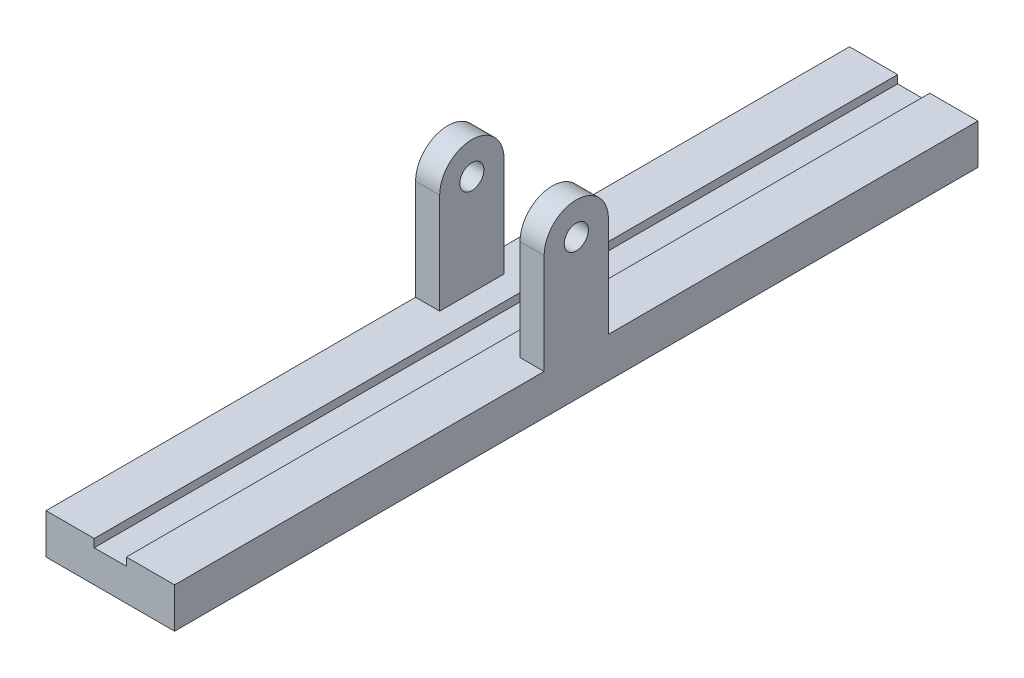
ISO-10303-21;
HEADER;
FILE_DESCRIPTION(('STEP AP214'),'2;1');
FILE_NAME('part.step','',(''),(''),'','','');
FILE_SCHEMA(('AUTOMOTIVE_DESIGN { 1 0 10303 214 1 1 1 1 }'));
ENDSEC;
DATA;
#1=APPLICATION_CONTEXT('core data for automotive mechanical design processes');
#2=APPLICATION_PROTOCOL_DEFINITION('international standard','automotive_design',2000,#1);
#3=PRODUCT_CONTEXT('',#1,'mechanical');
#4=PRODUCT('Part','Part','',(#3));
#5=PRODUCT_RELATED_PRODUCT_CATEGORY('part','',(#4));
#6=PRODUCT_DEFINITION_FORMATION('','',#4);
#7=PRODUCT_DEFINITION_CONTEXT('part definition',#1,'design');
#8=PRODUCT_DEFINITION('design','',#6,#7);
#9=PRODUCT_DEFINITION_SHAPE('','',#8);
#10=(LENGTH_UNIT() NAMED_UNIT(*) SI_UNIT(.MILLI.,.METRE.));
#11=(NAMED_UNIT(*) PLANE_ANGLE_UNIT() SI_UNIT($,.RADIAN.));
#12=(NAMED_UNIT(*) SI_UNIT($,.STERADIAN.) SOLID_ANGLE_UNIT());
#13=UNCERTAINTY_MEASURE_WITH_UNIT(LENGTH_MEASURE(1.E-05),#10,'distance_accuracy_value','');
#14=(GEOMETRIC_REPRESENTATION_CONTEXT(3) GLOBAL_UNCERTAINTY_ASSIGNED_CONTEXT((#13)) GLOBAL_UNIT_ASSIGNED_CONTEXT((#10,
#11,#12)) REPRESENTATION_CONTEXT('',''));
#15=CARTESIAN_POINT('',(0.,0.,0.));
#16=DIRECTION('',(0.,0.,1.));
#17=DIRECTION('',(1.,0.,0.));
#18=AXIS2_PLACEMENT_3D('',#15,#16,#17);
#19=CARTESIAN_POINT('',(-40.,25.,250.));
#20=DIRECTION('',(0.,-1.,0.));
#21=DIRECTION('',(0.,0.,-1.));
#22=AXIS2_PLACEMENT_3D('',#19,#20,#21);
#23=PLANE('',#22);
#24=DIRECTION('',(-1.,0.,0.));
#25=VECTOR('',#24,1.);
#26=CARTESIAN_POINT('',(-25.,25.,20.));
#27=LINE('',#26,#25);
#28=CARTESIAN_POINT('',(-25.,25.,20.));
#29=VERTEX_POINT('',#28);
#30=CARTESIAN_POINT('',(-40.,25.,20.));
#31=VERTEX_POINT('',#30);
#32=EDGE_CURVE('E168',#29,#31,#27,.T.);
#33=ORIENTED_EDGE('',*,*,#32,.T.);
#34=DIRECTION('',(0.,0.,-1.));
#35=VECTOR('',#34,1.);
#36=CARTESIAN_POINT('',(-40.,25.,250.));
#37=LINE('',#36,#35);
#38=CARTESIAN_POINT('',(-40.,25.,250.));
#39=VERTEX_POINT('',#38);
#40=EDGE_CURVE('E258',#39,#31,#37,.T.);
#41=ORIENTED_EDGE('',*,*,#40,.F.);
#42=DIRECTION('',(-1.,0.,0.));
#43=VECTOR('',#42,1.);
#44=CARTESIAN_POINT('',(-40.,25.,250.));
#45=LINE('',#44,#43);
#46=CARTESIAN_POINT('',(-9.99999999999999,25.,250.));
#47=VERTEX_POINT('',#46);
#48=EDGE_CURVE('E238',#47,#39,#45,.T.);
#49=ORIENTED_EDGE('',*,*,#48,.F.);
#50=DIRECTION('',(0.,0.,-1.));
#51=VECTOR('',#50,1.);
#52=CARTESIAN_POINT('',(-9.99999999999999,25.,250.));
#53=LINE('',#52,#51);
#54=CARTESIAN_POINT('',(-9.99999999999999,25.,-250.));
#55=VERTEX_POINT('',#54);
#56=EDGE_CURVE('E261',#47,#55,#53,.T.);
#57=ORIENTED_EDGE('',*,*,#56,.T.);
#58=DIRECTION('',(-1.,0.,0.));
#59=VECTOR('',#58,1.);
#60=CARTESIAN_POINT('',(-40.,25.,-250.));
#61=LINE('',#60,#59);
#62=CARTESIAN_POINT('',(-40.,25.,-250.));
#63=VERTEX_POINT('',#62);
#64=EDGE_CURVE('E226',#55,#63,#61,.T.);
#65=ORIENTED_EDGE('',*,*,#64,.T.);
#66=CARTESIAN_POINT('',(-40.,25.,-20.));
#67=VERTEX_POINT('',#66);
#68=EDGE_CURVE('E240',#67,#63,#37,.T.);
#69=ORIENTED_EDGE('',*,*,#68,.F.);
#70=DIRECTION('',(-1.,0.,0.));
#71=VECTOR('',#70,1.);
#72=CARTESIAN_POINT('',(-25.,25.,-20.));
#73=LINE('',#72,#71);
#74=CARTESIAN_POINT('',(-24.9999999999999,25.,-20.));
#75=VERTEX_POINT('',#74);
#76=EDGE_CURVE('E54',#75,#67,#73,.T.);
#77=ORIENTED_EDGE('',*,*,#76,.F.);
#78=DIRECTION('',(0.,0.,-1.));
#79=VECTOR('',#78,1.);
#80=CARTESIAN_POINT('',(-25.,25.,20.));
#81=LINE('',#80,#79);
#82=EDGE_CURVE('E49',#29,#75,#81,.T.);
#83=ORIENTED_EDGE('',*,*,#82,.F.);
#84=EDGE_LOOP('',(#33,#41,#49,#57,#65,#69,#77,#83));
#85=FACE_BOUND('',#84,.T.);
#86=ADVANCED_FACE('F34',(#85),#23,.F.);
#87=CARTESIAN_POINT('',(-40.,25.,250.));
#88=DIRECTION('',(1.,0.,0.));
#89=DIRECTION('',(0.,1.,0.));
#90=AXIS2_PLACEMENT_3D('',#87,#88,#89);
#91=PLANE('',#90);
#92=DIRECTION('',(0.,-1.,0.));
#93=VECTOR('',#92,1.);
#94=CARTESIAN_POINT('',(-40.,25.,-250.));
#95=LINE('',#94,#93);
#96=CARTESIAN_POINT('',(-40.,0.,-250.));
#97=VERTEX_POINT('',#96);
#98=EDGE_CURVE('E214',#63,#97,#95,.T.);
#99=ORIENTED_EDGE('',*,*,#98,.T.);
#100=DIRECTION('',(0.,0.,-1.));
#101=VECTOR('',#100,1.);
#102=CARTESIAN_POINT('',(-40.,0.,250.));
#103=LINE('',#102,#101);
#104=CARTESIAN_POINT('',(-40.,0.,250.));
#105=VERTEX_POINT('',#104);
#106=EDGE_CURVE('E11',#105,#97,#103,.T.);
#107=ORIENTED_EDGE('',*,*,#106,.F.);
#108=DIRECTION('',(0.,-1.,0.));
#109=VECTOR('',#108,1.);
#110=CARTESIAN_POINT('',(-40.,25.,250.));
#111=LINE('',#110,#109);
#112=EDGE_CURVE('E222',#39,#105,#111,.T.);
#113=ORIENTED_EDGE('',*,*,#112,.F.);
#114=ORIENTED_EDGE('',*,*,#40,.T.);
#115=DIRECTION('',(0.,-1.,0.));
#116=VECTOR('',#115,1.);
#117=CARTESIAN_POINT('',(-40.,25.,20.));
#118=LINE('',#117,#116);
#119=CARTESIAN_POINT('',(-39.9999999999999,87.5,20.));
#120=VERTEX_POINT('',#119);
#121=EDGE_CURVE('E178',#120,#31,#118,.T.);
#122=ORIENTED_EDGE('',*,*,#121,.F.);
#123=CARTESIAN_POINT('',(-39.9999999999999,87.5,0.));
#124=DIRECTION('',(1.,0.,0.));
#125=DIRECTION('',(0.,1.,0.));
#126=AXIS2_PLACEMENT_3D('',#123,#124,#125);
#127=CIRCLE('',#126,20.);
#128=CARTESIAN_POINT('',(-39.9999999999999,87.5000000000001,-20.));
#129=VERTEX_POINT('',#128);
#130=EDGE_CURVE('E161',#129,#120,#127,.T.);
#131=ORIENTED_EDGE('',*,*,#130,.F.);
#132=DIRECTION('',(0.,1.,0.));
#133=VECTOR('',#132,1.);
#134=CARTESIAN_POINT('',(-40.,25.,-20.));
#135=LINE('',#134,#133);
#136=EDGE_CURVE('E169',#67,#129,#135,.T.);
#137=ORIENTED_EDGE('',*,*,#136,.F.);
#138=ORIENTED_EDGE('',*,*,#68,.T.);
#139=EDGE_LOOP('',(#99,#107,#113,#114,#122,#131,#137,#138));
#140=FACE_BOUND('',#139,.T.);
#141=CARTESIAN_POINT('',(-39.9999999999999,87.5,0.));
#142=DIRECTION('',(1.,0.,0.));
#143=DIRECTION('',(0.,1.,0.));
#144=AXIS2_PLACEMENT_3D('',#141,#142,#143);
#145=CIRCLE('',#144,7.5);
#146=CARTESIAN_POINT('',(-39.9999999999999,95.,0.));
#147=VERTEX_POINT('',#146);
#148=EDGE_CURVE('E173',#147,#147,#145,.T.);
#149=ORIENTED_EDGE('',*,*,#148,.T.);
#150=EDGE_LOOP('',(#149));
#151=FACE_BOUND('',#150,.T.);
#152=ADVANCED_FACE('F36',(#140,#151),#91,.F.);
#153=CARTESIAN_POINT('',(-40.,0.,250.));
#154=DIRECTION('',(0.,1.,0.));
#155=DIRECTION('',(0.,0.,1.));
#156=AXIS2_PLACEMENT_3D('',#153,#154,#155);
#157=PLANE('',#156);
#158=DIRECTION('',(1.,0.,0.));
#159=VECTOR('',#158,1.);
#160=CARTESIAN_POINT('',(-40.,0.,-250.));
#161=LINE('',#160,#159);
#162=CARTESIAN_POINT('',(40.,0.,-250.));
#163=VERTEX_POINT('',#162);
#164=EDGE_CURVE('E243',#97,#163,#161,.T.);
#165=ORIENTED_EDGE('',*,*,#164,.T.);
#166=DIRECTION('',(0.,0.,-1.));
#167=VECTOR('',#166,1.);
#168=CARTESIAN_POINT('',(40.,0.,250.));
#169=LINE('',#168,#167);
#170=CARTESIAN_POINT('',(40.,0.,250.));
#171=VERTEX_POINT('',#170);
#172=EDGE_CURVE('E42',#171,#163,#169,.T.);
#173=ORIENTED_EDGE('',*,*,#172,.F.);
#174=DIRECTION('',(1.,0.,0.));
#175=VECTOR('',#174,1.);
#176=CARTESIAN_POINT('',(-40.,0.,250.));
#177=LINE('',#176,#175);
#178=EDGE_CURVE('E225',#105,#171,#177,.T.);
#179=ORIENTED_EDGE('',*,*,#178,.F.);
#180=ORIENTED_EDGE('',*,*,#106,.T.);
#181=EDGE_LOOP('',(#165,#173,#179,#180));
#182=FACE_BOUND('',#181,.T.);
#183=ADVANCED_FACE('F334',(#182),#157,.F.);
#184=CARTESIAN_POINT('',(40.,25.,250.));
#185=DIRECTION('',(-1.,0.,0.));
#186=DIRECTION('',(0.,-1.,0.));
#187=AXIS2_PLACEMENT_3D('',#184,#185,#186);
#188=PLANE('',#187);
#189=DIRECTION('',(0.,1.,0.));
#190=VECTOR('',#189,1.);
#191=CARTESIAN_POINT('',(40.,25.,-250.));
#192=LINE('',#191,#190);
#193=CARTESIAN_POINT('',(40.,25.,-250.));
#194=VERTEX_POINT('',#193);
#195=EDGE_CURVE('E245',#163,#194,#192,.T.);
#196=ORIENTED_EDGE('',*,*,#195,.T.);
#197=DIRECTION('',(0.,0.,-1.));
#198=VECTOR('',#197,1.);
#199=CARTESIAN_POINT('',(40.,25.,250.));
#200=LINE('',#199,#198);
#201=CARTESIAN_POINT('',(40.,25.,-20.));
#202=VERTEX_POINT('',#201);
#203=EDGE_CURVE('E273',#202,#194,#200,.T.);
#204=ORIENTED_EDGE('',*,*,#203,.F.);
#205=DIRECTION('',(0.,1.,0.));
#206=VECTOR('',#205,1.);
#207=CARTESIAN_POINT('',(40.,25.,-20.));
#208=LINE('',#207,#206);
#209=CARTESIAN_POINT('',(40.,87.5,-20.));
#210=VERTEX_POINT('',#209);
#211=EDGE_CURVE('E207',#202,#210,#208,.T.);
#212=ORIENTED_EDGE('',*,*,#211,.T.);
#213=CARTESIAN_POINT('',(40.,87.5,0.));
#214=DIRECTION('',(1.,0.,0.));
#215=DIRECTION('',(0.,1.,0.));
#216=AXIS2_PLACEMENT_3D('',#213,#214,#215);
#217=CIRCLE('',#216,20.);
#218=CARTESIAN_POINT('',(40.,87.5,20.));
#219=VERTEX_POINT('',#218);
#220=EDGE_CURVE('E196',#210,#219,#217,.T.);
#221=ORIENTED_EDGE('',*,*,#220,.T.);
#222=DIRECTION('',(0.,-1.,0.));
#223=VECTOR('',#222,1.);
#224=CARTESIAN_POINT('',(40.,25.,20.));
#225=LINE('',#224,#223);
#226=CARTESIAN_POINT('',(40.,25.,20.));
#227=VERTEX_POINT('',#226);
#228=EDGE_CURVE('E189',#219,#227,#225,.T.);
#229=ORIENTED_EDGE('',*,*,#228,.T.);
#230=CARTESIAN_POINT('',(40.,25.,250.));
#231=VERTEX_POINT('',#230);
#232=EDGE_CURVE('E274',#231,#227,#200,.T.);
#233=ORIENTED_EDGE('',*,*,#232,.F.);
#234=DIRECTION('',(0.,1.,0.));
#235=VECTOR('',#234,1.);
#236=CARTESIAN_POINT('',(40.,25.,250.));
#237=LINE('',#236,#235);
#238=EDGE_CURVE('E228',#171,#231,#237,.T.);
#239=ORIENTED_EDGE('',*,*,#238,.F.);
#240=ORIENTED_EDGE('',*,*,#172,.T.);
#241=EDGE_LOOP('',(#196,#204,#212,#221,#229,#233,#239,#240));
#242=FACE_BOUND('',#241,.T.);
#243=CARTESIAN_POINT('',(40.,87.5,0.));
#244=DIRECTION('',(1.,0.,0.));
#245=DIRECTION('',(0.,1.,0.));
#246=AXIS2_PLACEMENT_3D('',#243,#244,#245);
#247=CIRCLE('',#246,7.5);
#248=CARTESIAN_POINT('',(40.,95.,0.));
#249=VERTEX_POINT('',#248);
#250=EDGE_CURVE('E183',#249,#249,#247,.T.);
#251=ORIENTED_EDGE('',*,*,#250,.F.);
#252=EDGE_LOOP('',(#251));
#253=FACE_BOUND('',#252,.T.);
#254=ADVANCED_FACE('F280',(#242,#253),#188,.F.);
#255=CARTESIAN_POINT('',(10.,25.,250.));
#256=DIRECTION('',(0.,-1.,0.));
#257=DIRECTION('',(0.,0.,-1.));
#258=AXIS2_PLACEMENT_3D('',#255,#256,#257);
#259=PLANE('',#258);
#260=ORIENTED_EDGE('',*,*,#232,.T.);
#261=DIRECTION('',(1.,0.,0.));
#262=VECTOR('',#261,1.);
#263=CARTESIAN_POINT('',(25.,25.,20.));
#264=LINE('',#263,#262);
#265=CARTESIAN_POINT('',(25.,25.,20.));
#266=VERTEX_POINT('',#265);
#267=EDGE_CURVE('E204',#266,#227,#264,.T.);
#268=ORIENTED_EDGE('',*,*,#267,.F.);
#269=DIRECTION('',(0.,0.,-1.));
#270=VECTOR('',#269,1.);
#271=CARTESIAN_POINT('',(25.,25.,20.));
#272=LINE('',#271,#270);
#273=CARTESIAN_POINT('',(25.,25.,-20.0000000000001));
#274=VERTEX_POINT('',#273);
#275=EDGE_CURVE('E195',#266,#274,#272,.T.);
#276=ORIENTED_EDGE('',*,*,#275,.T.);
#277=DIRECTION('',(1.,0.,0.));
#278=VECTOR('',#277,1.);
#279=CARTESIAN_POINT('',(25.,25.,-20.));
#280=LINE('',#279,#278);
#281=EDGE_CURVE('E217',#274,#202,#280,.T.);
#282=ORIENTED_EDGE('',*,*,#281,.T.);
#283=ORIENTED_EDGE('',*,*,#203,.T.);
#284=DIRECTION('',(-1.,0.,0.));
#285=VECTOR('',#284,1.);
#286=CARTESIAN_POINT('',(10.,25.,-250.));
#287=LINE('',#286,#285);
#288=CARTESIAN_POINT('',(10.,25.,-250.));
#289=VERTEX_POINT('',#288);
#290=EDGE_CURVE('E248',#194,#289,#287,.T.);
#291=ORIENTED_EDGE('',*,*,#290,.T.);
#292=DIRECTION('',(0.,0.,-1.));
#293=VECTOR('',#292,1.);
#294=CARTESIAN_POINT('',(10.,25.,250.));
#295=LINE('',#294,#293);
#296=CARTESIAN_POINT('',(10.,25.,250.));
#297=VERTEX_POINT('',#296);
#298=EDGE_CURVE('E270',#297,#289,#295,.T.);
#299=ORIENTED_EDGE('',*,*,#298,.F.);
#300=DIRECTION('',(-1.,0.,0.));
#301=VECTOR('',#300,1.);
#302=CARTESIAN_POINT('',(10.,25.,250.));
#303=LINE('',#302,#301);
#304=EDGE_CURVE('E230',#231,#297,#303,.T.);
#305=ORIENTED_EDGE('',*,*,#304,.F.);
#306=EDGE_LOOP('',(#260,#268,#276,#282,#283,#291,#299,#305));
#307=FACE_BOUND('',#306,.T.);
#308=ADVANCED_FACE('F292',(#307),#259,.F.);
#309=CARTESIAN_POINT('',(10.,25.,250.));
#310=DIRECTION('',(1.,0.,0.));
#311=DIRECTION('',(0.,0.,-1.));
#312=AXIS2_PLACEMENT_3D('',#309,#310,#311);
#313=PLANE('',#312);
#314=DIRECTION('',(0.,-1.,0.));
#315=VECTOR('',#314,1.);
#316=CARTESIAN_POINT('',(10.,25.,-250.));
#317=LINE('',#316,#315);
#318=CARTESIAN_POINT('',(10.,20.,-250.));
#319=VERTEX_POINT('',#318);
#320=EDGE_CURVE('E250',#289,#319,#317,.T.);
#321=ORIENTED_EDGE('',*,*,#320,.T.);
#322=DIRECTION('',(0.,0.,-1.));
#323=VECTOR('',#322,1.);
#324=CARTESIAN_POINT('',(10.,20.,250.));
#325=LINE('',#324,#323);
#326=CARTESIAN_POINT('',(10.,20.,250.));
#327=VERTEX_POINT('',#326);
#328=EDGE_CURVE('E267',#327,#319,#325,.T.);
#329=ORIENTED_EDGE('',*,*,#328,.F.);
#330=DIRECTION('',(0.,-1.,0.));
#331=VECTOR('',#330,1.);
#332=CARTESIAN_POINT('',(10.,25.,250.));
#333=LINE('',#332,#331);
#334=EDGE_CURVE('E232',#297,#327,#333,.T.);
#335=ORIENTED_EDGE('',*,*,#334,.F.);
#336=ORIENTED_EDGE('',*,*,#298,.T.);
#337=EDGE_LOOP('',(#321,#329,#335,#336));
#338=FACE_BOUND('',#337,.T.);
#339=ADVANCED_FACE('F296',(#338),#313,.F.);
#340=CARTESIAN_POINT('',(-9.99999999999999,20.,250.));
#341=DIRECTION('',(0.,-1.,0.));
#342=DIRECTION('',(1.,0.,0.));
#343=AXIS2_PLACEMENT_3D('',#340,#341,#342);
#344=PLANE('',#343);
#345=DIRECTION('',(-1.,0.,0.));
#346=VECTOR('',#345,1.);
#347=CARTESIAN_POINT('',(-9.99999999999999,20.,-250.));
#348=LINE('',#347,#346);
#349=CARTESIAN_POINT('',(-9.99999999999999,20.,-250.));
#350=VERTEX_POINT('',#349);
#351=EDGE_CURVE('E252',#319,#350,#348,.T.);
#352=ORIENTED_EDGE('',*,*,#351,.T.);
#353=DIRECTION('',(0.,0.,-1.));
#354=VECTOR('',#353,1.);
#355=CARTESIAN_POINT('',(-9.99999999999999,20.,250.));
#356=LINE('',#355,#354);
#357=CARTESIAN_POINT('',(-9.99999999999999,20.,250.));
#358=VERTEX_POINT('',#357);
#359=EDGE_CURVE('E264',#358,#350,#356,.T.);
#360=ORIENTED_EDGE('',*,*,#359,.F.);
#361=DIRECTION('',(-1.,0.,0.));
#362=VECTOR('',#361,1.);
#363=CARTESIAN_POINT('',(-9.99999999999999,20.,250.));
#364=LINE('',#363,#362);
#365=EDGE_CURVE('E234',#327,#358,#364,.T.);
#366=ORIENTED_EDGE('',*,*,#365,.F.);
#367=ORIENTED_EDGE('',*,*,#328,.T.);
#368=EDGE_LOOP('',(#352,#360,#366,#367));
#369=FACE_BOUND('',#368,.T.);
#370=ADVANCED_FACE('F342',(#369),#344,.F.);
#371=CARTESIAN_POINT('',(-9.99999999999999,25.,250.));
#372=DIRECTION('',(-1.,0.,0.));
#373=DIRECTION('',(0.,0.,1.));
#374=AXIS2_PLACEMENT_3D('',#371,#372,#373);
#375=PLANE('',#374);
#376=DIRECTION('',(0.,1.,0.));
#377=VECTOR('',#376,1.);
#378=CARTESIAN_POINT('',(-9.99999999999999,25.,-250.));
#379=LINE('',#378,#377);
#380=EDGE_CURVE('E254',#350,#55,#379,.T.);
#381=ORIENTED_EDGE('',*,*,#380,.T.);
#382=ORIENTED_EDGE('',*,*,#56,.F.);
#383=DIRECTION('',(0.,1.,0.));
#384=VECTOR('',#383,1.);
#385=CARTESIAN_POINT('',(-9.99999999999999,25.,250.));
#386=LINE('',#385,#384);
#387=EDGE_CURVE('E236',#358,#47,#386,.T.);
#388=ORIENTED_EDGE('',*,*,#387,.F.);
#389=ORIENTED_EDGE('',*,*,#359,.T.);
#390=EDGE_LOOP('',(#381,#382,#388,#389));
#391=FACE_BOUND('',#390,.T.);
#392=ADVANCED_FACE('F339',(#391),#375,.F.);
#393=CARTESIAN_POINT('',(0.,0.,250.));
#394=DIRECTION('',(0.,0.,1.));
#395=DIRECTION('',(1.,0.,0.));
#396=AXIS2_PLACEMENT_3D('',#393,#394,#395);
#397=PLANE('',#396);
#398=ORIENTED_EDGE('',*,*,#112,.T.);
#399=ORIENTED_EDGE('',*,*,#178,.T.);
#400=ORIENTED_EDGE('',*,*,#238,.T.);
#401=ORIENTED_EDGE('',*,*,#304,.T.);
#402=ORIENTED_EDGE('',*,*,#334,.T.);
#403=ORIENTED_EDGE('',*,*,#365,.T.);
#404=ORIENTED_EDGE('',*,*,#387,.T.);
#405=ORIENTED_EDGE('',*,*,#48,.T.);
#406=EDGE_LOOP('',(#398,#399,#400,#401,#402,#403,#404,#405));
#407=FACE_BOUND('',#406,.T.);
#408=ADVANCED_FACE('F300',(#407),#397,.T.);
#409=CARTESIAN_POINT('',(0.,0.,-250.));
#410=DIRECTION('',(0.,0.,1.));
#411=DIRECTION('',(1.,0.,0.));
#412=AXIS2_PLACEMENT_3D('',#409,#410,#411);
#413=PLANE('',#412);
#414=ORIENTED_EDGE('',*,*,#98,.F.);
#415=ORIENTED_EDGE('',*,*,#64,.F.);
#416=ORIENTED_EDGE('',*,*,#380,.F.);
#417=ORIENTED_EDGE('',*,*,#351,.F.);
#418=ORIENTED_EDGE('',*,*,#320,.F.);
#419=ORIENTED_EDGE('',*,*,#290,.F.);
#420=ORIENTED_EDGE('',*,*,#195,.F.);
#421=ORIENTED_EDGE('',*,*,#164,.F.);
#422=EDGE_LOOP('',(#414,#415,#416,#417,#418,#419,#420,#421));
#423=FACE_BOUND('',#422,.T.);
#424=ADVANCED_FACE('F287',(#423),#413,.F.);
#425=CARTESIAN_POINT('',(25.,25.,20.));
#426=DIRECTION('',(0.,0.,1.));
#427=DIRECTION('',(0.,-1.,0.));
#428=AXIS2_PLACEMENT_3D('',#425,#426,#427);
#429=PLANE('',#428);
#430=ORIENTED_EDGE('',*,*,#228,.F.);
#431=DIRECTION('',(1.,0.,0.));
#432=VECTOR('',#431,1.);
#433=CARTESIAN_POINT('',(25.,87.5,20.));
#434=LINE('',#433,#432);
#435=CARTESIAN_POINT('',(25.,87.5,20.));
#436=VERTEX_POINT('',#435);
#437=EDGE_CURVE('E212',#436,#219,#434,.T.);
#438=ORIENTED_EDGE('',*,*,#437,.F.);
#439=DIRECTION('',(0.,-1.,0.));
#440=VECTOR('',#439,1.);
#441=CARTESIAN_POINT('',(25.,25.,20.));
#442=LINE('',#441,#440);
#443=EDGE_CURVE('E192',#436,#266,#442,.T.);
#444=ORIENTED_EDGE('',*,*,#443,.T.);
#445=ORIENTED_EDGE('',*,*,#267,.T.);
#446=EDGE_LOOP('',(#430,#438,#444,#445));
#447=FACE_BOUND('',#446,.T.);
#448=ADVANCED_FACE('F305',(#447),#429,.T.);
#449=CARTESIAN_POINT('',(25.,87.5,0.));
#450=DIRECTION('',(1.,0.,0.));
#451=DIRECTION('',(0.,1.,0.));
#452=AXIS2_PLACEMENT_3D('',#449,#450,#451);
#453=CYLINDRICAL_SURFACE('',#452,20.);
#454=ORIENTED_EDGE('',*,*,#220,.F.);
#455=DIRECTION('',(1.,0.,0.));
#456=VECTOR('',#455,1.);
#457=CARTESIAN_POINT('',(25.,87.5,-20.));
#458=LINE('',#457,#456);
#459=CARTESIAN_POINT('',(25.,87.5,-20.));
#460=VERTEX_POINT('',#459);
#461=EDGE_CURVE('E215',#460,#210,#458,.T.);
#462=ORIENTED_EDGE('',*,*,#461,.F.);
#463=CARTESIAN_POINT('',(25.,87.5,0.));
#464=DIRECTION('',(1.,0.,0.));
#465=DIRECTION('',(0.,1.,0.));
#466=AXIS2_PLACEMENT_3D('',#463,#464,#465);
#467=CIRCLE('',#466,20.);
#468=EDGE_CURVE('E201',#460,#436,#467,.T.);
#469=ORIENTED_EDGE('',*,*,#468,.T.);
#470=ORIENTED_EDGE('',*,*,#437,.T.);
#471=EDGE_LOOP('',(#454,#462,#469,#470));
#472=FACE_BOUND('',#471,.T.);
#473=ADVANCED_FACE('F310',(#472),#453,.T.);
#474=CARTESIAN_POINT('',(25.,25.,-20.));
#475=DIRECTION('',(0.,0.,-1.));
#476=DIRECTION('',(0.,1.,0.));
#477=AXIS2_PLACEMENT_3D('',#474,#475,#476);
#478=PLANE('',#477);
#479=ORIENTED_EDGE('',*,*,#211,.F.);
#480=ORIENTED_EDGE('',*,*,#281,.F.);
#481=DIRECTION('',(0.,1.,0.));
#482=VECTOR('',#481,1.);
#483=CARTESIAN_POINT('',(25.,25.,-20.));
#484=LINE('',#483,#482);
#485=EDGE_CURVE('E198',#274,#460,#484,.T.);
#486=ORIENTED_EDGE('',*,*,#485,.T.);
#487=ORIENTED_EDGE('',*,*,#461,.T.);
#488=EDGE_LOOP('',(#479,#480,#486,#487));
#489=FACE_BOUND('',#488,.T.);
#490=ADVANCED_FACE('F317',(#489),#478,.T.);
#491=CARTESIAN_POINT('',(25.,87.5,0.));
#492=DIRECTION('',(1.,0.,0.));
#493=DIRECTION('',(0.,1.,0.));
#494=AXIS2_PLACEMENT_3D('',#491,#492,#493);
#495=PLANE('',#494);
#496=CARTESIAN_POINT('',(25.,87.5,0.));
#497=DIRECTION('',(1.,0.,0.));
#498=DIRECTION('',(0.,1.,0.));
#499=AXIS2_PLACEMENT_3D('',#496,#497,#498);
#500=CIRCLE('',#499,7.5);
#501=CARTESIAN_POINT('',(25.,95.,0.));
#502=VERTEX_POINT('',#501);
#503=EDGE_CURVE('E186',#502,#502,#500,.T.);
#504=ORIENTED_EDGE('',*,*,#503,.T.);
#505=EDGE_LOOP('',(#504));
#506=FACE_BOUND('',#505,.T.);
#507=ORIENTED_EDGE('',*,*,#443,.F.);
#508=ORIENTED_EDGE('',*,*,#468,.F.);
#509=ORIENTED_EDGE('',*,*,#485,.F.);
#510=ORIENTED_EDGE('',*,*,#275,.F.);
#511=EDGE_LOOP('',(#507,#508,#509,#510));
#512=FACE_BOUND('',#511,.T.);
#513=ADVANCED_FACE('F313',(#506,#512),#495,.F.);
#514=CARTESIAN_POINT('',(25.,87.5,0.));
#515=DIRECTION('',(1.,0.,0.));
#516=DIRECTION('',(0.,1.,0.));
#517=AXIS2_PLACEMENT_3D('',#514,#515,#516);
#518=CYLINDRICAL_SURFACE('',#517,7.5);
#519=ORIENTED_EDGE('',*,*,#503,.F.);
#520=EDGE_LOOP('',(#519));
#521=FACE_BOUND('',#520,.T.);
#522=ORIENTED_EDGE('',*,*,#250,.T.);
#523=EDGE_LOOP('',(#522));
#524=FACE_BOUND('',#523,.T.);
#525=ADVANCED_FACE('F324',(#521,#524),#518,.F.);
#526=CARTESIAN_POINT('',(-24.9999999999999,87.5,0.));
#527=DIRECTION('',(-1.,0.,0.));
#528=DIRECTION('',(0.,1.,0.));
#529=AXIS2_PLACEMENT_3D('',#526,#527,#528);
#530=PLANE('',#529);
#531=DIRECTION('',(0.,-1.,0.));
#532=VECTOR('',#531,1.);
#533=CARTESIAN_POINT('',(-25.,25.,20.));
#534=LINE('',#533,#532);
#535=CARTESIAN_POINT('',(-24.9999999999999,87.5,20.));
#536=VERTEX_POINT('',#535);
#537=EDGE_CURVE('E149',#536,#29,#534,.T.);
#538=ORIENTED_EDGE('',*,*,#537,.T.);
#539=ORIENTED_EDGE('',*,*,#82,.T.);
#540=DIRECTION('',(0.,1.,0.));
#541=VECTOR('',#540,1.);
#542=CARTESIAN_POINT('',(-25.,25.,-20.));
#543=LINE('',#542,#541);
#544=CARTESIAN_POINT('',(-24.9999999999999,87.5,-20.));
#545=VERTEX_POINT('',#544);
#546=EDGE_CURVE('E152',#75,#545,#543,.T.);
#547=ORIENTED_EDGE('',*,*,#546,.T.);
#548=CARTESIAN_POINT('',(-24.9999999999999,87.5,0.));
#549=DIRECTION('',(1.,0.,0.));
#550=DIRECTION('',(0.,1.,0.));
#551=AXIS2_PLACEMENT_3D('',#548,#549,#550);
#552=CIRCLE('',#551,20.);
#553=EDGE_CURVE('E144',#545,#536,#552,.T.);
#554=ORIENTED_EDGE('',*,*,#553,.T.);
#555=EDGE_LOOP('',(#538,#539,#547,#554));
#556=FACE_BOUND('',#555,.T.);
#557=CARTESIAN_POINT('',(-24.9999999999999,87.5,0.));
#558=DIRECTION('',(1.,0.,0.));
#559=DIRECTION('',(0.,1.,0.));
#560=AXIS2_PLACEMENT_3D('',#557,#558,#559);
#561=CIRCLE('',#560,7.5);
#562=CARTESIAN_POINT('',(-24.9999999999999,95.,0.));
#563=VERTEX_POINT('',#562);
#564=EDGE_CURVE('E180',#563,#563,#561,.T.);
#565=ORIENTED_EDGE('',*,*,#564,.F.);
#566=EDGE_LOOP('',(#565));
#567=FACE_BOUND('',#566,.T.);
#568=ADVANCED_FACE('F146',(#556,#567),#530,.F.);
#569=CARTESIAN_POINT('',(-25.,25.,20.));
#570=DIRECTION('',(0.,0.,-1.));
#571=DIRECTION('',(0.,1.,0.));
#572=AXIS2_PLACEMENT_3D('',#569,#570,#571);
#573=PLANE('',#572);
#574=ORIENTED_EDGE('',*,*,#121,.T.);
#575=ORIENTED_EDGE('',*,*,#32,.F.);
#576=ORIENTED_EDGE('',*,*,#537,.F.);
#577=DIRECTION('',(-1.,0.,0.));
#578=VECTOR('',#577,1.);
#579=CARTESIAN_POINT('',(-24.9999999999999,87.5,20.));
#580=LINE('',#579,#578);
#581=EDGE_CURVE('E158',#536,#120,#580,.T.);
#582=ORIENTED_EDGE('',*,*,#581,.T.);
#583=EDGE_LOOP('',(#574,#575,#576,#582));
#584=FACE_BOUND('',#583,.T.);
#585=ADVANCED_FACE('F167',(#584),#573,.F.);
#586=CARTESIAN_POINT('',(-25.,25.,-20.));
#587=DIRECTION('',(0.,0.,1.));
#588=DIRECTION('',(0.,-1.,0.));
#589=AXIS2_PLACEMENT_3D('',#586,#587,#588);
#590=PLANE('',#589);
#591=ORIENTED_EDGE('',*,*,#136,.T.);
#592=DIRECTION('',(-1.,0.,0.));
#593=VECTOR('',#592,1.);
#594=CARTESIAN_POINT('',(-24.9999999999999,87.5,-20.));
#595=LINE('',#594,#593);
#596=EDGE_CURVE('E165',#545,#129,#595,.T.);
#597=ORIENTED_EDGE('',*,*,#596,.F.);
#598=ORIENTED_EDGE('',*,*,#546,.F.);
#599=ORIENTED_EDGE('',*,*,#76,.T.);
#600=EDGE_LOOP('',(#591,#597,#598,#599));
#601=FACE_BOUND('',#600,.T.);
#602=ADVANCED_FACE('F366',(#601),#590,.F.);
#603=CARTESIAN_POINT('',(-24.9999999999999,87.5,0.));
#604=DIRECTION('',(-1.,0.,0.));
#605=DIRECTION('',(0.,-1.,0.));
#606=AXIS2_PLACEMENT_3D('',#603,#604,#605);
#607=CYLINDRICAL_SURFACE('',#606,20.);
#608=ORIENTED_EDGE('',*,*,#130,.T.);
#609=ORIENTED_EDGE('',*,*,#581,.F.);
#610=ORIENTED_EDGE('',*,*,#553,.F.);
#611=ORIENTED_EDGE('',*,*,#596,.T.);
#612=EDGE_LOOP('',(#608,#609,#610,#611));
#613=FACE_BOUND('',#612,.T.);
#614=ADVANCED_FACE('F159',(#613),#607,.T.);
#615=CARTESIAN_POINT('',(-24.9999999999999,87.5,0.));
#616=DIRECTION('',(-1.,0.,0.));
#617=DIRECTION('',(0.,-1.,0.));
#618=AXIS2_PLACEMENT_3D('',#615,#616,#617);
#619=CYLINDRICAL_SURFACE('',#618,7.5);
#620=ORIENTED_EDGE('',*,*,#564,.T.);
#621=EDGE_LOOP('',(#620));
#622=FACE_BOUND('',#621,.T.);
#623=ORIENTED_EDGE('',*,*,#148,.F.);
#624=EDGE_LOOP('',(#623));
#625=FACE_BOUND('',#624,.T.);
#626=ADVANCED_FACE('F373',(#622,#625),#619,.F.);
#627=CLOSED_SHELL('',(#86,#152,#183,#254,#308,#339,#370,#392,#408,#424,#448,#473,#490,#513,#525,
#568,#585,#602,#614,#626));
#628=MANIFOLD_SOLID_BREP('B2',#627);
#629=ADVANCED_BREP_SHAPE_REPRESENTATION('',(#18,#628),#14);
#630=SHAPE_DEFINITION_REPRESENTATION(#9,#629);
ENDSEC;
END-ISO-10303-21;
